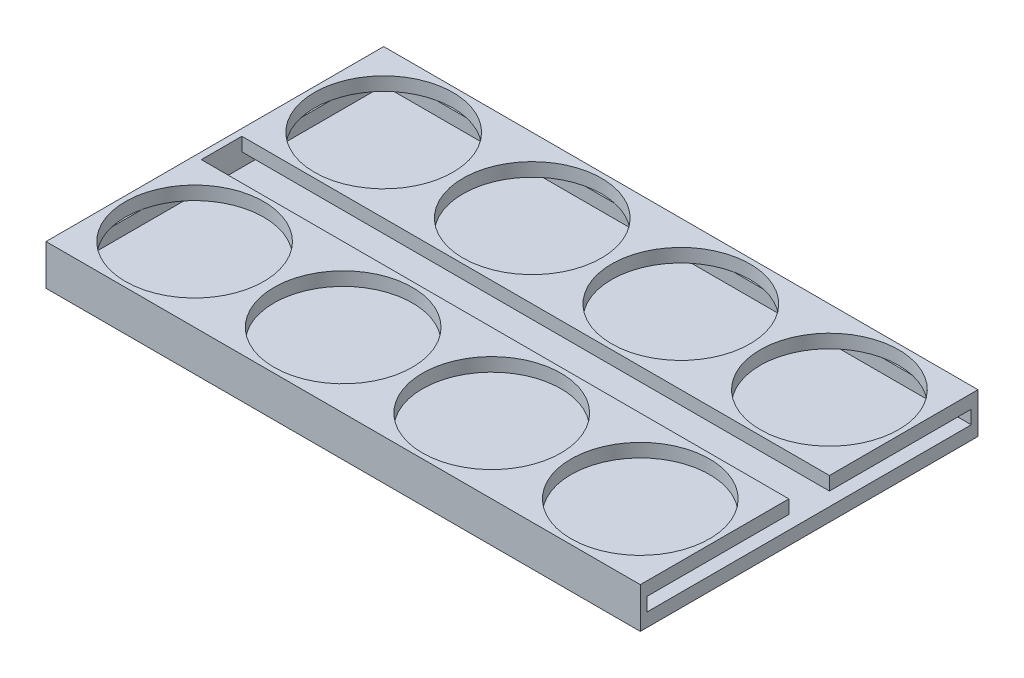
ISO-10303-21;
HEADER;
FILE_DESCRIPTION(('STEP AP214'),'2;1');
FILE_NAME('part.step','',(''),(''),'','','');
FILE_SCHEMA(('AUTOMOTIVE_DESIGN { 1 0 10303 214 1 1 1 1 }'));
ENDSEC;
DATA;
#1=APPLICATION_CONTEXT('core data for automotive mechanical design processes');
#2=APPLICATION_PROTOCOL_DEFINITION('international standard','automotive_design',2000,#1);
#3=PRODUCT_CONTEXT('',#1,'mechanical');
#4=PRODUCT('Part','Part','',(#3));
#5=PRODUCT_RELATED_PRODUCT_CATEGORY('part','',(#4));
#6=PRODUCT_DEFINITION_FORMATION('','',#4);
#7=PRODUCT_DEFINITION_CONTEXT('part definition',#1,'design');
#8=PRODUCT_DEFINITION('design','',#6,#7);
#9=PRODUCT_DEFINITION_SHAPE('','',#8);
#10=(LENGTH_UNIT() NAMED_UNIT(*) SI_UNIT(.MILLI.,.METRE.));
#11=(NAMED_UNIT(*) PLANE_ANGLE_UNIT() SI_UNIT($,.RADIAN.));
#12=(NAMED_UNIT(*) SI_UNIT($,.STERADIAN.) SOLID_ANGLE_UNIT());
#13=UNCERTAINTY_MEASURE_WITH_UNIT(LENGTH_MEASURE(1.E-05),#10,'distance_accuracy_value','');
#14=(GEOMETRIC_REPRESENTATION_CONTEXT(3) GLOBAL_UNCERTAINTY_ASSIGNED_CONTEXT((#13)) GLOBAL_UNIT_ASSIGNED_CONTEXT((#10,
#11,#12)) REPRESENTATION_CONTEXT('',''));
#15=CARTESIAN_POINT('',(0.,0.,0.));
#16=DIRECTION('',(0.,0.,1.));
#17=DIRECTION('',(1.,0.,0.));
#18=AXIS2_PLACEMENT_3D('',#15,#16,#17);
#19=CARTESIAN_POINT('',(1.,-2.,-0.999999999999951));
#20=DIRECTION('',(0.,1.,0.));
#21=DIRECTION('',(0.,0.,1.));
#22=AXIS2_PLACEMENT_3D('',#19,#20,#21);
#23=PLANE('',#22);
#24=DIRECTION('',(0.,0.,1.));
#25=VECTOR('',#24,1.);
#26=CARTESIAN_POINT('',(88.,-2.,-1.));
#27=LINE('',#26,#25);
#28=CARTESIAN_POINT('',(88.,-2.,-49.));
#29=VERTEX_POINT('',#28);
#30=CARTESIAN_POINT('',(88.,-2.,-28.));
#31=VERTEX_POINT('',#30);
#32=EDGE_CURVE('E207',#29,#31,#27,.T.);
#33=ORIENTED_EDGE('',*,*,#32,.T.);
#34=DIRECTION('',(-1.,0.,0.));
#35=VECTOR('',#34,1.);
#36=CARTESIAN_POINT('',(1.,-2.,-28.));
#37=LINE('',#36,#35);
#38=CARTESIAN_POINT('',(1.,-2.,-28.));
#39=VERTEX_POINT('',#38);
#40=EDGE_CURVE('E199',#31,#39,#37,.T.);
#41=ORIENTED_EDGE('',*,*,#40,.T.);
#42=DIRECTION('',(0.,0.,1.));
#43=VECTOR('',#42,1.);
#44=CARTESIAN_POINT('',(1.,-2.,-0.999999999999951));
#45=LINE('',#44,#43);
#46=CARTESIAN_POINT('',(0.99999999999998,-2.,-36.7500000000001));
#47=VERTEX_POINT('',#46);
#48=EDGE_CURVE('E751',#47,#39,#45,.T.);
#49=ORIENTED_EDGE('',*,*,#48,.F.);
#50=CARTESIAN_POINT('',(11.,-2.,-39.));
#51=DIRECTION('',(0.,1.,0.));
#52=DIRECTION('',(0.,0.,1.));
#53=AXIS2_PLACEMENT_3D('',#50,#51,#52);
#54=CIRCLE('',#53,10.25);
#55=CARTESIAN_POINT('',(13.25,-2.,-49.));
#56=VERTEX_POINT('',#55);
#57=EDGE_CURVE('E305',#47,#56,#54,.T.);
#58=ORIENTED_EDGE('',*,*,#57,.T.);
#59=DIRECTION('',(1.,0.,0.));
#60=VECTOR('',#59,1.);
#61=CARTESIAN_POINT('',(0.999999999999973,-2.,-49.));
#62=LINE('',#61,#60);
#63=CARTESIAN_POINT('',(30.75,-2.,-49.));
#64=VERTEX_POINT('',#63);
#65=EDGE_CURVE('E228',#56,#64,#62,.T.);
#66=ORIENTED_EDGE('',*,*,#65,.T.);
#67=CARTESIAN_POINT('',(33.,-2.,-39.));
#68=DIRECTION('',(0.,1.,0.));
#69=DIRECTION('',(0.,0.,1.));
#70=AXIS2_PLACEMENT_3D('',#67,#68,#69);
#71=CIRCLE('',#70,10.25);
#72=CARTESIAN_POINT('',(35.25,-2.,-49.));
#73=VERTEX_POINT('',#72);
#74=EDGE_CURVE('E297',#64,#73,#71,.T.);
#75=ORIENTED_EDGE('',*,*,#74,.T.);
#76=CARTESIAN_POINT('',(52.75,-2.,-49.));
#77=VERTEX_POINT('',#76);
#78=EDGE_CURVE('E736',#73,#77,#62,.T.);
#79=ORIENTED_EDGE('',*,*,#78,.T.);
#80=CARTESIAN_POINT('',(55.,-2.,-39.));
#81=DIRECTION('',(0.,1.,0.));
#82=DIRECTION('',(0.,0.,1.));
#83=AXIS2_PLACEMENT_3D('',#80,#81,#82);
#84=CIRCLE('',#83,10.25);
#85=CARTESIAN_POINT('',(57.25,-2.,-49.));
#86=VERTEX_POINT('',#85);
#87=EDGE_CURVE('E291',#77,#86,#84,.T.);
#88=ORIENTED_EDGE('',*,*,#87,.T.);
#89=CARTESIAN_POINT('',(74.75,-2.,-49.));
#90=VERTEX_POINT('',#89);
#91=EDGE_CURVE('E229',#86,#90,#62,.T.);
#92=ORIENTED_EDGE('',*,*,#91,.T.);
#93=CARTESIAN_POINT('',(77.,-2.,-39.));
#94=DIRECTION('',(0.,1.,0.));
#95=DIRECTION('',(0.,0.,1.));
#96=AXIS2_PLACEMENT_3D('',#93,#94,#95);
#97=CIRCLE('',#96,10.25);
#98=CARTESIAN_POINT('',(79.25,-2.,-49.));
#99=VERTEX_POINT('',#98);
#100=EDGE_CURVE('E314',#90,#99,#97,.T.);
#101=ORIENTED_EDGE('',*,*,#100,.T.);
#102=EDGE_CURVE('E233',#99,#29,#62,.T.);
#103=ORIENTED_EDGE('',*,*,#102,.T.);
#104=EDGE_LOOP('',(#33,#41,#49,#58,#66,#75,#79,#88,#92,#101,#103));
#105=FACE_BOUND('',#104,.T.);
#106=ADVANCED_FACE('F33',(#105),#23,.F.);
#107=CARTESIAN_POINT('',(0.999999999999973,-2.,-49.));
#108=VERTEX_POINT('',#107);
#109=CARTESIAN_POINT('',(8.74999999999996,-2.,-49.));
#110=VERTEX_POINT('',#109);
#111=EDGE_CURVE('E224',#108,#110,#62,.T.);
#112=ORIENTED_EDGE('',*,*,#111,.T.);
#113=CARTESIAN_POINT('',(0.999999999999977,-2.,-41.2499999999999));
#114=VERTEX_POINT('',#113);
#115=EDGE_CURVE('E304',#110,#114,#54,.T.);
#116=ORIENTED_EDGE('',*,*,#115,.T.);
#117=EDGE_CURVE('E237',#108,#114,#45,.T.);
#118=ORIENTED_EDGE('',*,*,#117,.F.);
#119=EDGE_LOOP('',(#112,#116,#118));
#120=FACE_BOUND('',#119,.T.);
#121=ADVANCED_FACE('F413',(#120),#23,.F.);
#122=CARTESIAN_POINT('',(0.999999999999989,-2.,-22.));
#123=VERTEX_POINT('',#122);
#124=CARTESIAN_POINT('',(0.999999999999993,-2.,-13.2499999999999));
#125=VERTEX_POINT('',#124);
#126=EDGE_CURVE('E198',#123,#125,#45,.T.);
#127=ORIENTED_EDGE('',*,*,#126,.F.);
#128=DIRECTION('',(1.,0.,0.));
#129=VECTOR('',#128,1.);
#130=CARTESIAN_POINT('',(1.,-2.,-22.));
#131=LINE('',#130,#129);
#132=CARTESIAN_POINT('',(88.,-2.,-22.));
#133=VERTEX_POINT('',#132);
#134=EDGE_CURVE('E48',#123,#133,#131,.T.);
#135=ORIENTED_EDGE('',*,*,#134,.T.);
#136=CARTESIAN_POINT('',(88.,-2.,-1.));
#137=VERTEX_POINT('',#136);
#138=EDGE_CURVE('E195',#133,#137,#27,.T.);
#139=ORIENTED_EDGE('',*,*,#138,.T.);
#140=DIRECTION('',(1.,0.,0.));
#141=VECTOR('',#140,1.);
#142=CARTESIAN_POINT('',(1.,-2.,-0.999999999999951));
#143=LINE('',#142,#141);
#144=CARTESIAN_POINT('',(79.2499999999999,-2.,-0.999999999999994));
#145=VERTEX_POINT('',#144);
#146=EDGE_CURVE('E227',#145,#137,#143,.T.);
#147=ORIENTED_EDGE('',*,*,#146,.F.);
#148=CARTESIAN_POINT('',(77.,-2.,-11.));
#149=DIRECTION('',(0.,1.,0.));
#150=DIRECTION('',(0.,0.,1.));
#151=AXIS2_PLACEMENT_3D('',#148,#149,#150);
#152=CIRCLE('',#151,10.25);
#153=CARTESIAN_POINT('',(74.7500000000001,-2.,-0.999999999999993));
#154=VERTEX_POINT('',#153);
#155=EDGE_CURVE('E340',#145,#154,#152,.T.);
#156=ORIENTED_EDGE('',*,*,#155,.T.);
#157=CARTESIAN_POINT('',(57.25,-2.,-0.999999999999982));
#158=VERTEX_POINT('',#157);
#159=EDGE_CURVE('E222',#158,#154,#143,.T.);
#160=ORIENTED_EDGE('',*,*,#159,.F.);
#161=CARTESIAN_POINT('',(55.,-2.,-11.));
#162=DIRECTION('',(0.,1.,0.));
#163=DIRECTION('',(0.,0.,1.));
#164=AXIS2_PLACEMENT_3D('',#161,#162,#163);
#165=CIRCLE('',#164,10.25);
#166=CARTESIAN_POINT('',(52.7500000000001,-2.,-0.999999999999979));
#167=VERTEX_POINT('',#166);
#168=EDGE_CURVE('E317',#158,#167,#165,.T.);
#169=ORIENTED_EDGE('',*,*,#168,.T.);
#170=CARTESIAN_POINT('',(35.25,-2.,-0.999999999999971));
#171=VERTEX_POINT('',#170);
#172=EDGE_CURVE('E387',#171,#167,#143,.T.);
#173=ORIENTED_EDGE('',*,*,#172,.F.);
#174=CARTESIAN_POINT('',(33.,-2.,-11.));
#175=DIRECTION('',(0.,1.,0.));
#176=DIRECTION('',(0.,0.,1.));
#177=AXIS2_PLACEMENT_3D('',#174,#175,#176);
#178=CIRCLE('',#177,10.25);
#179=CARTESIAN_POINT('',(30.7500000000001,-2.,-0.999999999999968));
#180=VERTEX_POINT('',#179);
#181=EDGE_CURVE('E325',#171,#180,#178,.T.);
#182=ORIENTED_EDGE('',*,*,#181,.T.);
#183=CARTESIAN_POINT('',(13.2499999999999,-2.,-0.999999999999957));
#184=VERTEX_POINT('',#183);
#185=EDGE_CURVE('E221',#184,#180,#143,.T.);
#186=ORIENTED_EDGE('',*,*,#185,.F.);
#187=CARTESIAN_POINT('',(11.,-2.,-11.));
#188=DIRECTION('',(0.,1.,0.));
#189=DIRECTION('',(0.,0.,1.));
#190=AXIS2_PLACEMENT_3D('',#187,#188,#189);
#191=CIRCLE('',#190,10.25);
#192=EDGE_CURVE('E332',#184,#125,#191,.T.);
#193=ORIENTED_EDGE('',*,*,#192,.T.);
#194=EDGE_LOOP('',(#127,#135,#139,#147,#156,#160,#169,#173,#182,#186,#193));
#195=FACE_BOUND('',#194,.T.);
#196=ADVANCED_FACE('F193',(#195),#23,.F.);
#197=CARTESIAN_POINT('',(0.,-6.,0.));
#198=DIRECTION('',(1.,0.,0.));
#199=DIRECTION('',(0.,0.,-1.));
#200=AXIS2_PLACEMENT_3D('',#197,#198,#199);
#201=PLANE('',#200);
#202=DIRECTION('',(0.,0.,-1.));
#203=VECTOR('',#202,1.);
#204=CARTESIAN_POINT('',(0.,0.,0.));
#205=LINE('',#204,#203);
#206=CARTESIAN_POINT('',(0.,0.,0.));
#207=VERTEX_POINT('',#206);
#208=CARTESIAN_POINT('',(0.,0.,-50.));
#209=VERTEX_POINT('',#208);
#210=EDGE_CURVE('E220',#207,#209,#205,.T.);
#211=ORIENTED_EDGE('',*,*,#210,.T.);
#212=DIRECTION('',(0.,1.,0.));
#213=VECTOR('',#212,1.);
#214=CARTESIAN_POINT('',(0.,-6.,-50.));
#215=LINE('',#214,#213);
#216=CARTESIAN_POINT('',(0.,-6.,-50.));
#217=VERTEX_POINT('',#216);
#218=EDGE_CURVE('E11',#217,#209,#215,.T.);
#219=ORIENTED_EDGE('',*,*,#218,.F.);
#220=DIRECTION('',(0.,0.,-1.));
#221=VECTOR('',#220,1.);
#222=CARTESIAN_POINT('',(0.,-6.,0.));
#223=LINE('',#222,#221);
#224=CARTESIAN_POINT('',(0.,-6.,0.));
#225=VERTEX_POINT('',#224);
#226=EDGE_CURVE('E238',#225,#217,#223,.T.);
#227=ORIENTED_EDGE('',*,*,#226,.F.);
#228=DIRECTION('',(0.,1.,0.));
#229=VECTOR('',#228,1.);
#230=CARTESIAN_POINT('',(0.,-6.,0.));
#231=LINE('',#230,#229);
#232=EDGE_CURVE('E250',#225,#207,#231,.T.);
#233=ORIENTED_EDGE('',*,*,#232,.T.);
#234=EDGE_LOOP('',(#211,#219,#227,#233));
#235=FACE_BOUND('',#234,.T.);
#236=ADVANCED_FACE('F35',(#235),#201,.F.);
#237=CARTESIAN_POINT('',(0.,-6.,-50.));
#238=DIRECTION('',(0.,0.,1.));
#239=DIRECTION('',(1.,0.,0.));
#240=AXIS2_PLACEMENT_3D('',#237,#238,#239);
#241=PLANE('',#240);
#242=DIRECTION('',(1.,0.,0.));
#243=VECTOR('',#242,1.);
#244=CARTESIAN_POINT('',(0.,0.,-50.));
#245=LINE('',#244,#243);
#246=CARTESIAN_POINT('',(88.,0.,-50.));
#247=VERTEX_POINT('',#246);
#248=EDGE_CURVE('E253',#209,#247,#245,.T.);
#249=ORIENTED_EDGE('',*,*,#248,.T.);
#250=DIRECTION('',(0.,1.,0.));
#251=VECTOR('',#250,1.);
#252=CARTESIAN_POINT('',(88.,-6.,-50.));
#253=LINE('',#252,#251);
#254=CARTESIAN_POINT('',(88.,-6.,-50.));
#255=VERTEX_POINT('',#254);
#256=EDGE_CURVE('E41',#255,#247,#253,.T.);
#257=ORIENTED_EDGE('',*,*,#256,.F.);
#258=DIRECTION('',(1.,0.,0.));
#259=VECTOR('',#258,1.);
#260=CARTESIAN_POINT('',(0.,-6.,-50.));
#261=LINE('',#260,#259);
#262=EDGE_CURVE('E241',#217,#255,#261,.T.);
#263=ORIENTED_EDGE('',*,*,#262,.F.);
#264=ORIENTED_EDGE('',*,*,#218,.T.);
#265=EDGE_LOOP('',(#249,#257,#263,#264));
#266=FACE_BOUND('',#265,.T.);
#267=ADVANCED_FACE('F268',(#266),#241,.F.);
#268=CARTESIAN_POINT('',(88.,-6.,0.));
#269=DIRECTION('',(1.,0.,0.));
#270=DIRECTION('',(0.,0.,-1.));
#271=AXIS2_PLACEMENT_3D('',#268,#269,#270);
#272=PLANE('',#271);
#273=DIRECTION('',(0.,1.,0.));
#274=VECTOR('',#273,1.);
#275=CARTESIAN_POINT('',(88.,-2.,-28.));
#276=LINE('',#275,#274);
#277=CARTESIAN_POINT('',(88.,0.,-28.));
#278=VERTEX_POINT('',#277);
#279=EDGE_CURVE('E188',#31,#278,#276,.T.);
#280=ORIENTED_EDGE('',*,*,#279,.F.);
#281=ORIENTED_EDGE('',*,*,#32,.F.);
#282=DIRECTION('',(0.,1.,0.));
#283=VECTOR('',#282,1.);
#284=CARTESIAN_POINT('',(88.,-2.,-49.));
#285=LINE('',#284,#283);
#286=CARTESIAN_POINT('',(88.,-4.,-49.));
#287=VERTEX_POINT('',#286);
#288=EDGE_CURVE('E208',#287,#29,#285,.T.);
#289=ORIENTED_EDGE('',*,*,#288,.F.);
#290=DIRECTION('',(0.,0.,-1.));
#291=VECTOR('',#290,1.);
#292=CARTESIAN_POINT('',(88.,-4.,-1.));
#293=LINE('',#292,#291);
#294=CARTESIAN_POINT('',(88.,-4.,-0.999999999999952));
#295=VERTEX_POINT('',#294);
#296=EDGE_CURVE('E213',#295,#287,#293,.T.);
#297=ORIENTED_EDGE('',*,*,#296,.F.);
#298=DIRECTION('',(0.,-1.,0.));
#299=VECTOR('',#298,1.);
#300=CARTESIAN_POINT('',(88.,-2.,-1.));
#301=LINE('',#300,#299);
#302=EDGE_CURVE('E206',#137,#295,#301,.T.);
#303=ORIENTED_EDGE('',*,*,#302,.F.);
#304=ORIENTED_EDGE('',*,*,#138,.F.);
#305=DIRECTION('',(0.,1.,0.));
#306=VECTOR('',#305,1.);
#307=CARTESIAN_POINT('',(88.,-2.,-22.));
#308=LINE('',#307,#306);
#309=CARTESIAN_POINT('',(88.,0.,-22.));
#310=VERTEX_POINT('',#309);
#311=EDGE_CURVE('E180',#133,#310,#308,.T.);
#312=ORIENTED_EDGE('',*,*,#311,.T.);
#313=DIRECTION('',(0.,0.,-1.));
#314=VECTOR('',#313,1.);
#315=CARTESIAN_POINT('',(88.,0.,0.));
#316=LINE('',#315,#314);
#317=CARTESIAN_POINT('',(88.,0.,0.));
#318=VERTEX_POINT('',#317);
#319=EDGE_CURVE('E257',#318,#310,#316,.T.);
#320=ORIENTED_EDGE('',*,*,#319,.F.);
#321=DIRECTION('',(0.,1.,0.));
#322=VECTOR('',#321,1.);
#323=CARTESIAN_POINT('',(88.,-6.,0.));
#324=LINE('',#323,#322);
#325=CARTESIAN_POINT('',(88.,-6.,0.));
#326=VERTEX_POINT('',#325);
#327=EDGE_CURVE('E262',#326,#318,#324,.T.);
#328=ORIENTED_EDGE('',*,*,#327,.F.);
#329=DIRECTION('',(0.,0.,-1.));
#330=VECTOR('',#329,1.);
#331=CARTESIAN_POINT('',(88.,-6.,0.));
#332=LINE('',#331,#330);
#333=EDGE_CURVE('E244',#326,#255,#332,.T.);
#334=ORIENTED_EDGE('',*,*,#333,.T.);
#335=ORIENTED_EDGE('',*,*,#256,.T.);
#336=EDGE_CURVE('E256',#278,#247,#316,.T.);
#337=ORIENTED_EDGE('',*,*,#336,.F.);
#338=EDGE_LOOP('',(#280,#281,#289,#297,#303,#304,#312,#320,#328,#334,#335,#337));
#339=FACE_BOUND('',#338,.T.);
#340=ADVANCED_FACE('F204',(#339),#272,.T.);
#341=CARTESIAN_POINT('',(0.,-6.,0.));
#342=DIRECTION('',(0.,0.,1.));
#343=DIRECTION('',(1.,0.,0.));
#344=AXIS2_PLACEMENT_3D('',#341,#342,#343);
#345=PLANE('',#344);
#346=DIRECTION('',(1.,0.,0.));
#347=VECTOR('',#346,1.);
#348=CARTESIAN_POINT('',(0.,0.,0.));
#349=LINE('',#348,#347);
#350=EDGE_CURVE('E242',#207,#318,#349,.T.);
#351=ORIENTED_EDGE('',*,*,#350,.F.);
#352=ORIENTED_EDGE('',*,*,#232,.F.);
#353=DIRECTION('',(1.,0.,0.));
#354=VECTOR('',#353,1.);
#355=CARTESIAN_POINT('',(0.,-6.,0.));
#356=LINE('',#355,#354);
#357=EDGE_CURVE('E247',#225,#326,#356,.T.);
#358=ORIENTED_EDGE('',*,*,#357,.T.);
#359=ORIENTED_EDGE('',*,*,#327,.T.);
#360=EDGE_LOOP('',(#351,#352,#358,#359));
#361=FACE_BOUND('',#360,.T.);
#362=ADVANCED_FACE('F440',(#361),#345,.T.);
#363=CARTESIAN_POINT('',(0.,-6.,0.));
#364=DIRECTION('',(0.,-1.,0.));
#365=DIRECTION('',(0.,0.,-1.));
#366=AXIS2_PLACEMENT_3D('',#363,#364,#365);
#367=PLANE('',#366);
#368=ORIENTED_EDGE('',*,*,#226,.T.);
#369=ORIENTED_EDGE('',*,*,#262,.T.);
#370=ORIENTED_EDGE('',*,*,#333,.F.);
#371=ORIENTED_EDGE('',*,*,#357,.F.);
#372=EDGE_LOOP('',(#368,#369,#370,#371));
#373=FACE_BOUND('',#372,.T.);
#374=ADVANCED_FACE('F442',(#373),#367,.T.);
#375=CARTESIAN_POINT('',(0.,0.,0.));
#376=DIRECTION('',(0.,-1.,0.));
#377=DIRECTION('',(0.,0.,-1.));
#378=AXIS2_PLACEMENT_3D('',#375,#376,#377);
#379=PLANE('',#378);
#380=CARTESIAN_POINT('',(55.,0.,-39.));
#381=DIRECTION('',(0.,1.,0.));
#382=DIRECTION('',(0.,0.,1.));
#383=AXIS2_PLACEMENT_3D('',#380,#381,#382);
#384=CIRCLE('',#383,10.25);
#385=CARTESIAN_POINT('',(55.,0.,-28.75));
#386=VERTEX_POINT('',#385);
#387=EDGE_CURVE('E292',#386,#386,#384,.T.);
#388=ORIENTED_EDGE('',*,*,#387,.F.);
#389=EDGE_LOOP('',(#388));
#390=FACE_BOUND('',#389,.T.);
#391=CARTESIAN_POINT('',(33.,0.,-39.));
#392=DIRECTION('',(0.,1.,0.));
#393=DIRECTION('',(0.,0.,1.));
#394=AXIS2_PLACEMENT_3D('',#391,#392,#393);
#395=CIRCLE('',#394,10.25);
#396=CARTESIAN_POINT('',(33.,0.,-28.75));
#397=VERTEX_POINT('',#396);
#398=EDGE_CURVE('E298',#397,#397,#395,.T.);
#399=ORIENTED_EDGE('',*,*,#398,.F.);
#400=EDGE_LOOP('',(#399));
#401=FACE_BOUND('',#400,.T.);
#402=CARTESIAN_POINT('',(11.,0.,-39.));
#403=DIRECTION('',(0.,1.,0.));
#404=DIRECTION('',(0.,0.,1.));
#405=AXIS2_PLACEMENT_3D('',#402,#403,#404);
#406=CIRCLE('',#405,10.25);
#407=CARTESIAN_POINT('',(11.,0.,-28.75));
#408=VERTEX_POINT('',#407);
#409=EDGE_CURVE('E286',#408,#408,#406,.T.);
#410=ORIENTED_EDGE('',*,*,#409,.F.);
#411=EDGE_LOOP('',(#410));
#412=FACE_BOUND('',#411,.T.);
#413=CARTESIAN_POINT('',(77.,0.,-39.));
#414=DIRECTION('',(0.,1.,0.));
#415=DIRECTION('',(0.,0.,1.));
#416=AXIS2_PLACEMENT_3D('',#413,#414,#415);
#417=CIRCLE('',#416,10.25);
#418=CARTESIAN_POINT('',(77.,0.,-28.75));
#419=VERTEX_POINT('',#418);
#420=EDGE_CURVE('E309',#419,#419,#417,.T.);
#421=ORIENTED_EDGE('',*,*,#420,.F.);
#422=EDGE_LOOP('',(#421));
#423=FACE_BOUND('',#422,.T.);
#424=CARTESIAN_POINT('',(55.,0.,-11.));
#425=DIRECTION('',(0.,1.,0.));
#426=DIRECTION('',(0.,0.,1.));
#427=AXIS2_PLACEMENT_3D('',#424,#425,#426);
#428=CIRCLE('',#427,10.25);
#429=CARTESIAN_POINT('',(55.,0.,-0.749999999999994));
#430=VERTEX_POINT('',#429);
#431=EDGE_CURVE('E322',#430,#430,#428,.T.);
#432=ORIENTED_EDGE('',*,*,#431,.F.);
#433=EDGE_LOOP('',(#432));
#434=FACE_BOUND('',#433,.T.);
#435=CARTESIAN_POINT('',(33.,0.,-11.));
#436=DIRECTION('',(0.,1.,0.));
#437=DIRECTION('',(0.,0.,1.));
#438=AXIS2_PLACEMENT_3D('',#435,#436,#437);
#439=CIRCLE('',#438,10.25);
#440=CARTESIAN_POINT('',(33.,0.,-0.749999999999982));
#441=VERTEX_POINT('',#440);
#442=EDGE_CURVE('E329',#441,#441,#439,.T.);
#443=ORIENTED_EDGE('',*,*,#442,.F.);
#444=EDGE_LOOP('',(#443));
#445=FACE_BOUND('',#444,.T.);
#446=CARTESIAN_POINT('',(11.,0.,-11.));
#447=DIRECTION('',(0.,1.,0.));
#448=DIRECTION('',(0.,0.,1.));
#449=AXIS2_PLACEMENT_3D('',#446,#447,#448);
#450=CIRCLE('',#449,10.25);
#451=CARTESIAN_POINT('',(11.,0.,-0.749999999999969));
#452=VERTEX_POINT('',#451);
#453=EDGE_CURVE('E313',#452,#452,#450,.T.);
#454=ORIENTED_EDGE('',*,*,#453,.F.);
#455=EDGE_LOOP('',(#454));
#456=FACE_BOUND('',#455,.T.);
#457=CARTESIAN_POINT('',(77.,0.,-11.));
#458=DIRECTION('',(0.,1.,0.));
#459=DIRECTION('',(0.,0.,1.));
#460=AXIS2_PLACEMENT_3D('',#457,#458,#459);
#461=CIRCLE('',#460,10.25);
#462=CARTESIAN_POINT('',(77.,0.,-0.750000000000006));
#463=VERTEX_POINT('',#462);
#464=EDGE_CURVE('E339',#463,#463,#461,.T.);
#465=ORIENTED_EDGE('',*,*,#464,.F.);
#466=EDGE_LOOP('',(#465));
#467=FACE_BOUND('',#466,.T.);
#468=DIRECTION('',(0.,0.,1.));
#469=VECTOR('',#468,1.);
#470=CARTESIAN_POINT('',(1.,0.,-22.));
#471=LINE('',#470,#469);
#472=CARTESIAN_POINT('',(1.,0.,-28.));
#473=VERTEX_POINT('',#472);
#474=CARTESIAN_POINT('',(1.,0.,-22.));
#475=VERTEX_POINT('',#474);
#476=EDGE_CURVE('E278',#473,#475,#471,.T.);
#477=ORIENTED_EDGE('',*,*,#476,.F.);
#478=DIRECTION('',(-1.,0.,0.));
#479=VECTOR('',#478,1.);
#480=CARTESIAN_POINT('',(1.,0.,-28.));
#481=LINE('',#480,#479);
#482=EDGE_CURVE('E200',#278,#473,#481,.T.);
#483=ORIENTED_EDGE('',*,*,#482,.F.);
#484=ORIENTED_EDGE('',*,*,#336,.T.);
#485=ORIENTED_EDGE('',*,*,#248,.F.);
#486=ORIENTED_EDGE('',*,*,#210,.F.);
#487=ORIENTED_EDGE('',*,*,#350,.T.);
#488=ORIENTED_EDGE('',*,*,#319,.T.);
#489=DIRECTION('',(1.,0.,0.));
#490=VECTOR('',#489,1.);
#491=CARTESIAN_POINT('',(1.,0.,-22.));
#492=LINE('',#491,#490);
#493=EDGE_CURVE('E183',#475,#310,#492,.T.);
#494=ORIENTED_EDGE('',*,*,#493,.F.);
#495=EDGE_LOOP('',(#477,#483,#484,#485,#486,#487,#488,#494));
#496=FACE_BOUND('',#495,.T.);
#497=ADVANCED_FACE('F273',(#390,#401,#412,#423,#434,#445,#456,#467,#496),#379,.F.);
#498=CARTESIAN_POINT('',(1.,-2.,-0.999999999999951));
#499=DIRECTION('',(0.,0.,1.));
#500=DIRECTION('',(1.,0.,0.));
#501=AXIS2_PLACEMENT_3D('',#498,#499,#500);
#502=PLANE('',#501);
#503=ORIENTED_EDGE('',*,*,#302,.T.);
#504=DIRECTION('',(1.,0.,0.));
#505=VECTOR('',#504,1.);
#506=CARTESIAN_POINT('',(1.,-4.,-0.999999999999952));
#507=LINE('',#506,#505);
#508=CARTESIAN_POINT('',(1.,-4.,-0.999999999999952));
#509=VERTEX_POINT('',#508);
#510=EDGE_CURVE('E234',#509,#295,#507,.T.);
#511=ORIENTED_EDGE('',*,*,#510,.F.);
#512=DIRECTION('',(0.,-1.,0.));
#513=VECTOR('',#512,1.);
#514=CARTESIAN_POINT('',(1.,-2.,-0.999999999999951));
#515=LINE('',#514,#513);
#516=CARTESIAN_POINT('',(1.,-2.,-0.999999999999951));
#517=VERTEX_POINT('',#516);
#518=EDGE_CURVE('E211',#517,#509,#515,.T.);
#519=ORIENTED_EDGE('',*,*,#518,.F.);
#520=CARTESIAN_POINT('',(8.75000000000006,-2.,-0.999999999999954));
#521=VERTEX_POINT('',#520);
#522=EDGE_CURVE('E217',#517,#521,#143,.T.);
#523=ORIENTED_EDGE('',*,*,#522,.T.);
#524=DIRECTION('',(-1.,0.,0.));
#525=VECTOR('',#524,1.);
#526=CARTESIAN_POINT('',(1.,-2.,-0.999999999999951));
#527=LINE('',#526,#525);
#528=EDGE_CURVE('E320',#184,#521,#527,.T.);
#529=ORIENTED_EDGE('',*,*,#528,.F.);
#530=ORIENTED_EDGE('',*,*,#185,.T.);
#531=EDGE_CURVE('E384',#180,#171,#143,.T.);
#532=ORIENTED_EDGE('',*,*,#531,.T.);
#533=ORIENTED_EDGE('',*,*,#172,.T.);
#534=EDGE_CURVE('E390',#167,#158,#143,.T.);
#535=ORIENTED_EDGE('',*,*,#534,.T.);
#536=ORIENTED_EDGE('',*,*,#159,.T.);
#537=EDGE_CURVE('E223',#154,#145,#143,.T.);
#538=ORIENTED_EDGE('',*,*,#537,.T.);
#539=ORIENTED_EDGE('',*,*,#146,.T.);
#540=EDGE_LOOP('',(#503,#511,#519,#523,#529,#530,#532,#533,#535,#536,#538,#539));
#541=FACE_BOUND('',#540,.T.);
#542=ADVANCED_FACE('F379',(#541),#502,.F.);
#543=CARTESIAN_POINT('',(0.999999999999996,-2.,-8.75));
#544=VERTEX_POINT('',#543);
#545=EDGE_CURVE('E354',#544,#517,#45,.T.);
#546=ORIENTED_EDGE('',*,*,#545,.F.);
#547=EDGE_CURVE('E759',#544,#521,#191,.T.);
#548=ORIENTED_EDGE('',*,*,#547,.T.);
#549=ORIENTED_EDGE('',*,*,#522,.F.);
#550=EDGE_LOOP('',(#546,#548,#549));
#551=FACE_BOUND('',#550,.T.);
#552=ADVANCED_FACE('F416',(#551),#23,.F.);
#553=CARTESIAN_POINT('',(0.999999999999973,-2.,-49.));
#554=DIRECTION('',(0.,0.,-1.));
#555=DIRECTION('',(-1.,0.,0.));
#556=AXIS2_PLACEMENT_3D('',#553,#554,#555);
#557=PLANE('',#556);
#558=ORIENTED_EDGE('',*,*,#288,.T.);
#559=ORIENTED_EDGE('',*,*,#102,.F.);
#560=EDGE_CURVE('E230',#90,#99,#62,.T.);
#561=ORIENTED_EDGE('',*,*,#560,.F.);
#562=ORIENTED_EDGE('',*,*,#91,.F.);
#563=EDGE_CURVE('E737',#77,#86,#62,.T.);
#564=ORIENTED_EDGE('',*,*,#563,.F.);
#565=ORIENTED_EDGE('',*,*,#78,.F.);
#566=EDGE_CURVE('E740',#64,#73,#62,.T.);
#567=ORIENTED_EDGE('',*,*,#566,.F.);
#568=ORIENTED_EDGE('',*,*,#65,.F.);
#569=DIRECTION('',(1.,0.,0.));
#570=VECTOR('',#569,1.);
#571=CARTESIAN_POINT('',(0.999999999999973,-2.,-49.));
#572=LINE('',#571,#570);
#573=EDGE_CURVE('E290',#110,#56,#572,.T.);
#574=ORIENTED_EDGE('',*,*,#573,.F.);
#575=ORIENTED_EDGE('',*,*,#111,.F.);
#576=DIRECTION('',(0.,1.,0.));
#577=VECTOR('',#576,1.);
#578=CARTESIAN_POINT('',(0.999999999999973,-2.,-49.));
#579=LINE('',#578,#577);
#580=CARTESIAN_POINT('',(0.999999999999973,-4.,-49.));
#581=VERTEX_POINT('',#580);
#582=EDGE_CURVE('E351',#581,#108,#579,.T.);
#583=ORIENTED_EDGE('',*,*,#582,.F.);
#584=DIRECTION('',(1.,0.,0.));
#585=VECTOR('',#584,1.);
#586=CARTESIAN_POINT('',(0.999999999999973,-4.,-49.));
#587=LINE('',#586,#585);
#588=EDGE_CURVE('E231',#581,#287,#587,.T.);
#589=ORIENTED_EDGE('',*,*,#588,.T.);
#590=EDGE_LOOP('',(#558,#559,#561,#562,#564,#565,#567,#568,#574,#575,#583,#589));
#591=FACE_BOUND('',#590,.T.);
#592=ADVANCED_FACE('F368',(#591),#557,.F.);
#593=CARTESIAN_POINT('',(1.,-4.,-0.999999999999952));
#594=DIRECTION('',(0.,-1.,0.));
#595=DIRECTION('',(0.,0.,-1.));
#596=AXIS2_PLACEMENT_3D('',#593,#594,#595);
#597=PLANE('',#596);
#598=ORIENTED_EDGE('',*,*,#296,.T.);
#599=ORIENTED_EDGE('',*,*,#588,.F.);
#600=DIRECTION('',(0.,0.,-1.));
#601=VECTOR('',#600,1.);
#602=CARTESIAN_POINT('',(1.,-4.,-0.999999999999952));
#603=LINE('',#602,#601);
#604=EDGE_CURVE('E348',#509,#581,#603,.T.);
#605=ORIENTED_EDGE('',*,*,#604,.F.);
#606=ORIENTED_EDGE('',*,*,#510,.T.);
#607=EDGE_LOOP('',(#598,#599,#605,#606));
#608=FACE_BOUND('',#607,.T.);
#609=ADVANCED_FACE('F362',(#608),#597,.F.);
#610=CARTESIAN_POINT('',(1.,0.,0.));
#611=DIRECTION('',(1.,0.,0.));
#612=DIRECTION('',(0.,0.,-1.));
#613=AXIS2_PLACEMENT_3D('',#610,#611,#612);
#614=PLANE('',#613);
#615=ORIENTED_EDGE('',*,*,#518,.T.);
#616=ORIENTED_EDGE('',*,*,#604,.T.);
#617=ORIENTED_EDGE('',*,*,#582,.T.);
#618=ORIENTED_EDGE('',*,*,#117,.T.);
#619=EDGE_CURVE('E357',#114,#47,#45,.T.);
#620=ORIENTED_EDGE('',*,*,#619,.T.);
#621=ORIENTED_EDGE('',*,*,#48,.T.);
#622=DIRECTION('',(0.,1.,0.));
#623=VECTOR('',#622,1.);
#624=CARTESIAN_POINT('',(1.,-2.,-28.));
#625=LINE('',#624,#623);
#626=EDGE_CURVE('E284',#39,#473,#625,.T.);
#627=ORIENTED_EDGE('',*,*,#626,.T.);
#628=ORIENTED_EDGE('',*,*,#476,.T.);
#629=DIRECTION('',(0.,1.,0.));
#630=VECTOR('',#629,1.);
#631=CARTESIAN_POINT('',(1.,-2.,-22.));
#632=LINE('',#631,#630);
#633=EDGE_CURVE('E189',#123,#475,#632,.T.);
#634=ORIENTED_EDGE('',*,*,#633,.F.);
#635=ORIENTED_EDGE('',*,*,#126,.T.);
#636=EDGE_CURVE('E358',#125,#544,#45,.T.);
#637=ORIENTED_EDGE('',*,*,#636,.T.);
#638=ORIENTED_EDGE('',*,*,#545,.T.);
#639=EDGE_LOOP('',(#615,#616,#617,#618,#620,#621,#627,#628,#634,#635,#637,#638));
#640=FACE_BOUND('',#639,.T.);
#641=ADVANCED_FACE('F373',(#640),#614,.T.);
#642=CARTESIAN_POINT('',(77.,-2.,-11.));
#643=DIRECTION('',(0.,1.,0.));
#644=DIRECTION('',(0.,0.,1.));
#645=AXIS2_PLACEMENT_3D('',#642,#643,#644);
#646=PLANE('',#645);
#647=ORIENTED_EDGE('',*,*,#537,.F.);
#648=EDGE_CURVE('E343',#154,#145,#152,.T.);
#649=ORIENTED_EDGE('',*,*,#648,.T.);
#650=EDGE_LOOP('',(#647,#649));
#651=FACE_BOUND('',#650,.T.);
#652=ADVANCED_FACE('F401',(#651),#646,.T.);
#653=CARTESIAN_POINT('',(77.,-2.,-11.));
#654=DIRECTION('',(0.,1.,0.));
#655=DIRECTION('',(0.,0.,1.));
#656=AXIS2_PLACEMENT_3D('',#653,#654,#655);
#657=CYLINDRICAL_SURFACE('',#656,10.25);
#658=ORIENTED_EDGE('',*,*,#155,.F.);
#659=ORIENTED_EDGE('',*,*,#648,.F.);
#660=EDGE_LOOP('',(#658,#659));
#661=FACE_BOUND('',#660,.T.);
#662=ORIENTED_EDGE('',*,*,#464,.T.);
#663=EDGE_LOOP('',(#662));
#664=FACE_BOUND('',#663,.T.);
#665=ADVANCED_FACE('F398',(#661,#664),#657,.F.);
#666=CARTESIAN_POINT('',(11.,-2.,-11.));
#667=DIRECTION('',(0.,1.,0.));
#668=DIRECTION('',(0.,0.,1.));
#669=AXIS2_PLACEMENT_3D('',#666,#667,#668);
#670=PLANE('',#669);
#671=ORIENTED_EDGE('',*,*,#528,.T.);
#672=EDGE_CURVE('E335',#521,#184,#191,.T.);
#673=ORIENTED_EDGE('',*,*,#672,.T.);
#674=EDGE_LOOP('',(#671,#673));
#675=FACE_BOUND('',#674,.T.);
#676=ADVANCED_FACE('F408',(#675),#670,.T.);
#677=CARTESIAN_POINT('',(11.,-2.,-11.));
#678=DIRECTION('',(0.,1.,0.));
#679=DIRECTION('',(0.,0.,1.));
#680=AXIS2_PLACEMENT_3D('',#677,#678,#679);
#681=CYLINDRICAL_SURFACE('',#680,10.25);
#682=ORIENTED_EDGE('',*,*,#192,.F.);
#683=ORIENTED_EDGE('',*,*,#672,.F.);
#684=ORIENTED_EDGE('',*,*,#547,.F.);
#685=EDGE_CURVE('E334',#125,#544,#191,.T.);
#686=ORIENTED_EDGE('',*,*,#685,.F.);
#687=EDGE_LOOP('',(#682,#683,#684,#686));
#688=FACE_BOUND('',#687,.T.);
#689=ORIENTED_EDGE('',*,*,#453,.T.);
#690=EDGE_LOOP('',(#689));
#691=FACE_BOUND('',#690,.T.);
#692=ADVANCED_FACE('F510',(#688,#691),#681,.F.);
#693=ORIENTED_EDGE('',*,*,#685,.T.);
#694=ORIENTED_EDGE('',*,*,#636,.F.);
#695=EDGE_LOOP('',(#693,#694));
#696=FACE_BOUND('',#695,.T.);
#697=ADVANCED_FACE('F513',(#696),#670,.T.);
#698=CARTESIAN_POINT('',(33.,-2.,-11.));
#699=DIRECTION('',(0.,1.,0.));
#700=DIRECTION('',(0.,0.,1.));
#701=AXIS2_PLACEMENT_3D('',#698,#699,#700);
#702=PLANE('',#701);
#703=ORIENTED_EDGE('',*,*,#531,.F.);
#704=EDGE_CURVE('E328',#180,#171,#178,.T.);
#705=ORIENTED_EDGE('',*,*,#704,.T.);
#706=EDGE_LOOP('',(#703,#705));
#707=FACE_BOUND('',#706,.T.);
#708=ADVANCED_FACE('F529',(#707),#702,.T.);
#709=CARTESIAN_POINT('',(33.,-2.,-11.));
#710=DIRECTION('',(0.,1.,0.));
#711=DIRECTION('',(0.,0.,1.));
#712=AXIS2_PLACEMENT_3D('',#709,#710,#711);
#713=CYLINDRICAL_SURFACE('',#712,10.25);
#714=ORIENTED_EDGE('',*,*,#181,.F.);
#715=ORIENTED_EDGE('',*,*,#704,.F.);
#716=EDGE_LOOP('',(#714,#715));
#717=FACE_BOUND('',#716,.T.);
#718=ORIENTED_EDGE('',*,*,#442,.T.);
#719=EDGE_LOOP('',(#718));
#720=FACE_BOUND('',#719,.T.);
#721=ADVANCED_FACE('F538',(#717,#720),#713,.F.);
#722=CARTESIAN_POINT('',(55.,-2.,-11.));
#723=DIRECTION('',(0.,1.,0.));
#724=DIRECTION('',(0.,0.,1.));
#725=AXIS2_PLACEMENT_3D('',#722,#723,#724);
#726=PLANE('',#725);
#727=ORIENTED_EDGE('',*,*,#534,.F.);
#728=EDGE_CURVE('E321',#167,#158,#165,.T.);
#729=ORIENTED_EDGE('',*,*,#728,.T.);
#730=EDGE_LOOP('',(#727,#729));
#731=FACE_BOUND('',#730,.T.);
#732=ADVANCED_FACE('F548',(#731),#726,.T.);
#733=CARTESIAN_POINT('',(55.,-2.,-11.));
#734=DIRECTION('',(0.,1.,0.));
#735=DIRECTION('',(0.,0.,1.));
#736=AXIS2_PLACEMENT_3D('',#733,#734,#735);
#737=CYLINDRICAL_SURFACE('',#736,10.25);
#738=ORIENTED_EDGE('',*,*,#168,.F.);
#739=ORIENTED_EDGE('',*,*,#728,.F.);
#740=EDGE_LOOP('',(#738,#739));
#741=FACE_BOUND('',#740,.T.);
#742=ORIENTED_EDGE('',*,*,#431,.T.);
#743=EDGE_LOOP('',(#742));
#744=FACE_BOUND('',#743,.T.);
#745=ADVANCED_FACE('F558',(#741,#744),#737,.F.);
#746=CARTESIAN_POINT('',(77.,-2.,-39.));
#747=DIRECTION('',(0.,1.,0.));
#748=DIRECTION('',(0.,0.,1.));
#749=AXIS2_PLACEMENT_3D('',#746,#747,#748);
#750=PLANE('',#749);
#751=ORIENTED_EDGE('',*,*,#560,.T.);
#752=EDGE_CURVE('E310',#99,#90,#97,.T.);
#753=ORIENTED_EDGE('',*,*,#752,.T.);
#754=EDGE_LOOP('',(#751,#753));
#755=FACE_BOUND('',#754,.T.);
#756=ADVANCED_FACE('F568',(#755),#750,.T.);
#757=CARTESIAN_POINT('',(77.,-2.,-39.));
#758=DIRECTION('',(0.,1.,0.));
#759=DIRECTION('',(0.,0.,1.));
#760=AXIS2_PLACEMENT_3D('',#757,#758,#759);
#761=CYLINDRICAL_SURFACE('',#760,10.25);
#762=ORIENTED_EDGE('',*,*,#752,.F.);
#763=ORIENTED_EDGE('',*,*,#100,.F.);
#764=EDGE_LOOP('',(#762,#763));
#765=FACE_BOUND('',#764,.T.);
#766=ORIENTED_EDGE('',*,*,#420,.T.);
#767=EDGE_LOOP('',(#766));
#768=FACE_BOUND('',#767,.T.);
#769=ADVANCED_FACE('F578',(#765,#768),#761,.F.);
#770=CARTESIAN_POINT('',(11.,-2.,-39.));
#771=DIRECTION('',(0.,1.,0.));
#772=DIRECTION('',(0.,0.,1.));
#773=AXIS2_PLACEMENT_3D('',#770,#771,#772);
#774=PLANE('',#773);
#775=ORIENTED_EDGE('',*,*,#573,.T.);
#776=EDGE_CURVE('E301',#56,#110,#54,.T.);
#777=ORIENTED_EDGE('',*,*,#776,.T.);
#778=EDGE_LOOP('',(#775,#777));
#779=FACE_BOUND('',#778,.T.);
#780=ADVANCED_FACE('F588',(#779),#774,.T.);
#781=CARTESIAN_POINT('',(11.,-2.,-39.));
#782=DIRECTION('',(0.,1.,0.));
#783=DIRECTION('',(0.,0.,1.));
#784=AXIS2_PLACEMENT_3D('',#781,#782,#783);
#785=CYLINDRICAL_SURFACE('',#784,10.25);
#786=ORIENTED_EDGE('',*,*,#776,.F.);
#787=ORIENTED_EDGE('',*,*,#57,.F.);
#788=EDGE_CURVE('E765',#114,#47,#54,.T.);
#789=ORIENTED_EDGE('',*,*,#788,.F.);
#790=ORIENTED_EDGE('',*,*,#115,.F.);
#791=EDGE_LOOP('',(#786,#787,#789,#790));
#792=FACE_BOUND('',#791,.T.);
#793=ORIENTED_EDGE('',*,*,#409,.T.);
#794=EDGE_LOOP('',(#793));
#795=FACE_BOUND('',#794,.T.);
#796=ADVANCED_FACE('F609',(#792,#795),#785,.F.);
#797=ORIENTED_EDGE('',*,*,#788,.T.);
#798=ORIENTED_EDGE('',*,*,#619,.F.);
#799=EDGE_LOOP('',(#797,#798));
#800=FACE_BOUND('',#799,.T.);
#801=ADVANCED_FACE('F612',(#800),#774,.T.);
#802=CARTESIAN_POINT('',(33.,-2.,-39.));
#803=DIRECTION('',(0.,1.,0.));
#804=DIRECTION('',(0.,0.,1.));
#805=AXIS2_PLACEMENT_3D('',#802,#803,#804);
#806=PLANE('',#805);
#807=ORIENTED_EDGE('',*,*,#566,.T.);
#808=EDGE_CURVE('E295',#73,#64,#71,.T.);
#809=ORIENTED_EDGE('',*,*,#808,.T.);
#810=EDGE_LOOP('',(#807,#809));
#811=FACE_BOUND('',#810,.T.);
#812=ADVANCED_FACE('F629',(#811),#806,.T.);
#813=CARTESIAN_POINT('',(33.,-2.,-39.));
#814=DIRECTION('',(0.,1.,0.));
#815=DIRECTION('',(0.,0.,1.));
#816=AXIS2_PLACEMENT_3D('',#813,#814,#815);
#817=CYLINDRICAL_SURFACE('',#816,10.25);
#818=ORIENTED_EDGE('',*,*,#808,.F.);
#819=ORIENTED_EDGE('',*,*,#74,.F.);
#820=EDGE_LOOP('',(#818,#819));
#821=FACE_BOUND('',#820,.T.);
#822=ORIENTED_EDGE('',*,*,#398,.T.);
#823=EDGE_LOOP('',(#822));
#824=FACE_BOUND('',#823,.T.);
#825=ADVANCED_FACE('F638',(#821,#824),#817,.F.);
#826=CARTESIAN_POINT('',(55.,-2.,-39.));
#827=DIRECTION('',(0.,1.,0.));
#828=DIRECTION('',(0.,0.,1.));
#829=AXIS2_PLACEMENT_3D('',#826,#827,#828);
#830=PLANE('',#829);
#831=ORIENTED_EDGE('',*,*,#563,.T.);
#832=EDGE_CURVE('E55',#86,#77,#84,.T.);
#833=ORIENTED_EDGE('',*,*,#832,.T.);
#834=EDGE_LOOP('',(#831,#833));
#835=FACE_BOUND('',#834,.T.);
#836=ADVANCED_FACE('F648',(#835),#830,.T.);
#837=CARTESIAN_POINT('',(55.,-2.,-39.));
#838=DIRECTION('',(0.,1.,0.));
#839=DIRECTION('',(0.,0.,1.));
#840=AXIS2_PLACEMENT_3D('',#837,#838,#839);
#841=CYLINDRICAL_SURFACE('',#840,10.25);
#842=ORIENTED_EDGE('',*,*,#832,.F.);
#843=ORIENTED_EDGE('',*,*,#87,.F.);
#844=EDGE_LOOP('',(#842,#843));
#845=FACE_BOUND('',#844,.T.);
#846=ORIENTED_EDGE('',*,*,#387,.T.);
#847=EDGE_LOOP('',(#846));
#848=FACE_BOUND('',#847,.T.);
#849=ADVANCED_FACE('F658',(#845,#848),#841,.F.);
#850=CARTESIAN_POINT('',(1.,-2.,-28.));
#851=DIRECTION('',(0.,0.,-1.));
#852=DIRECTION('',(-1.,0.,0.));
#853=AXIS2_PLACEMENT_3D('',#850,#851,#852);
#854=PLANE('',#853);
#855=ORIENTED_EDGE('',*,*,#482,.T.);
#856=ORIENTED_EDGE('',*,*,#626,.F.);
#857=ORIENTED_EDGE('',*,*,#40,.F.);
#858=ORIENTED_EDGE('',*,*,#279,.T.);
#859=EDGE_LOOP('',(#855,#856,#857,#858));
#860=FACE_BOUND('',#859,.T.);
#861=ADVANCED_FACE('F666',(#860),#854,.F.);
#862=CARTESIAN_POINT('',(1.,-2.,-22.));
#863=DIRECTION('',(0.,0.,1.));
#864=DIRECTION('',(1.,0.,0.));
#865=AXIS2_PLACEMENT_3D('',#862,#863,#864);
#866=PLANE('',#865);
#867=ORIENTED_EDGE('',*,*,#493,.T.);
#868=ORIENTED_EDGE('',*,*,#311,.F.);
#869=ORIENTED_EDGE('',*,*,#134,.F.);
#870=ORIENTED_EDGE('',*,*,#633,.T.);
#871=EDGE_LOOP('',(#867,#868,#869,#870));
#872=FACE_BOUND('',#871,.T.);
#873=ADVANCED_FACE('F181',(#872),#866,.F.);
#874=CLOSED_SHELL('',(#106,#121,#196,#236,#267,#340,#362,#374,#497,#542,#552,#592,#609,#641,
#652,#665,#676,#692,#697,#708,#721,#732,#745,#756,#769,#780,#796,#801,#812,#825,#836,#849,#861,#873));
#875=MANIFOLD_SOLID_BREP('B2',#874);
#876=ADVANCED_BREP_SHAPE_REPRESENTATION('',(#18,#875),#14);
#877=SHAPE_DEFINITION_REPRESENTATION(#9,#876);
ENDSEC;
END-ISO-10303-21;
